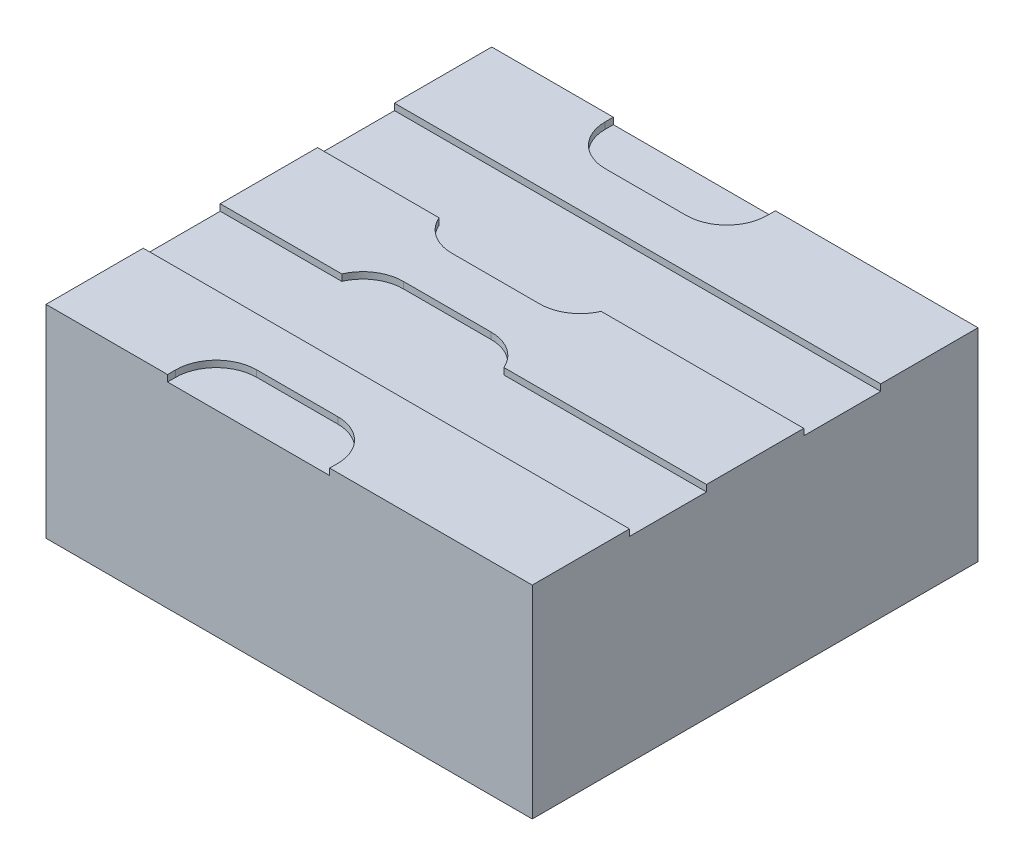
ISO-10303-21;
HEADER;
FILE_DESCRIPTION(('STEP AP214'),'2;1');
FILE_NAME('part.step','',(''),(''),'','','');
FILE_SCHEMA(('AUTOMOTIVE_DESIGN { 1 0 10303 214 1 1 1 1 }'));
ENDSEC;
DATA;
#1=APPLICATION_CONTEXT('core data for automotive mechanical design processes');
#2=APPLICATION_PROTOCOL_DEFINITION('international standard','automotive_design',2000,#1);
#3=PRODUCT_CONTEXT('',#1,'mechanical');
#4=PRODUCT('Part','Part','',(#3));
#5=PRODUCT_RELATED_PRODUCT_CATEGORY('part','',(#4));
#6=PRODUCT_DEFINITION_FORMATION('','',#4);
#7=PRODUCT_DEFINITION_CONTEXT('part definition',#1,'design');
#8=PRODUCT_DEFINITION('design','',#6,#7);
#9=PRODUCT_DEFINITION_SHAPE('','',#8);
#10=(LENGTH_UNIT() NAMED_UNIT(*) SI_UNIT(.MILLI.,.METRE.));
#11=(NAMED_UNIT(*) PLANE_ANGLE_UNIT() SI_UNIT($,.RADIAN.));
#12=(NAMED_UNIT(*) SI_UNIT($,.STERADIAN.) SOLID_ANGLE_UNIT());
#13=UNCERTAINTY_MEASURE_WITH_UNIT(LENGTH_MEASURE(1.E-05),#10,'distance_accuracy_value','');
#14=(GEOMETRIC_REPRESENTATION_CONTEXT(3) GLOBAL_UNCERTAINTY_ASSIGNED_CONTEXT((#13)) GLOBAL_UNIT_ASSIGNED_CONTEXT((#10,
#11,#12)) REPRESENTATION_CONTEXT('',''));
#15=CARTESIAN_POINT('',(0.,0.,0.));
#16=DIRECTION('',(0.,0.,1.));
#17=DIRECTION('',(1.,0.,0.));
#18=AXIS2_PLACEMENT_3D('',#15,#16,#17);
#19=CARTESIAN_POINT('',(1.31107446938112,1.17,0.));
#20=DIRECTION('',(0.,1.,0.));
#21=DIRECTION('',(-1.,0.,0.));
#22=AXIS2_PLACEMENT_3D('',#19,#20,#21);
#23=PLANE('',#22);
#24=DIRECTION('',(1.,0.,0.));
#25=VECTOR('',#24,1.);
#26=CARTESIAN_POINT('',(1.31107446938112,1.17,0.6));
#27=LINE('',#26,#25);
#28=CARTESIAN_POINT('',(0.500000000000001,1.17,0.600000000000001));
#29=VERTEX_POINT('',#28);
#30=CARTESIAN_POINT('',(3.,1.17,0.6));
#31=VERTEX_POINT('',#30);
#32=EDGE_CURVE('E251',#29,#31,#27,.T.);
#33=ORIENTED_EDGE('',*,*,#32,.F.);
#34=CARTESIAN_POINT('',(0.0417424305044164,1.17,0.8));
#35=DIRECTION('',(0.,1.,0.));
#36=DIRECTION('',(-1.,0.,0.));
#37=AXIS2_PLACEMENT_3D('',#34,#35,#36);
#38=CIRCLE('',#37,0.5);
#39=CARTESIAN_POINT('',(0.0417424305044164,1.17,0.3));
#40=VERTEX_POINT('',#39);
#41=EDGE_CURVE('E470',#29,#40,#38,.T.);
#42=ORIENTED_EDGE('',*,*,#41,.T.);
#43=DIRECTION('',(1.,0.,0.));
#44=VECTOR('',#43,1.);
#45=CARTESIAN_POINT('',(-1.99999999999999,1.17,0.3));
#46=LINE('',#45,#44);
#47=CARTESIAN_POINT('',(-1.04174243050442,1.17,0.3));
#48=VERTEX_POINT('',#47);
#49=EDGE_CURVE('E371',#48,#40,#46,.T.);
#50=ORIENTED_EDGE('',*,*,#49,.F.);
#51=CARTESIAN_POINT('',(-1.04174243050442,1.17,0.8));
#52=DIRECTION('',(0.,1.,0.));
#53=DIRECTION('',(-1.,0.,0.));
#54=AXIS2_PLACEMENT_3D('',#51,#52,#53);
#55=CIRCLE('',#54,0.5);
#56=CARTESIAN_POINT('',(-1.5,1.17,0.6));
#57=VERTEX_POINT('',#56);
#58=EDGE_CURVE('E468',#48,#57,#55,.T.);
#59=ORIENTED_EDGE('',*,*,#58,.T.);
#60=DIRECTION('',(1.,0.,0.));
#61=VECTOR('',#60,1.);
#62=CARTESIAN_POINT('',(1.31107446938112,1.17,0.6));
#63=LINE('',#62,#61);
#64=CARTESIAN_POINT('',(-3.,1.17,0.6));
#65=VERTEX_POINT('',#64);
#66=EDGE_CURVE('E292',#65,#57,#63,.T.);
#67=ORIENTED_EDGE('',*,*,#66,.F.);
#68=DIRECTION('',(0.,0.,1.));
#69=VECTOR('',#68,1.);
#70=CARTESIAN_POINT('',(-3.,1.17,2.75));
#71=LINE('',#70,#69);
#72=CARTESIAN_POINT('',(-3.,1.17,1.55));
#73=VERTEX_POINT('',#72);
#74=EDGE_CURVE('E405',#65,#73,#71,.T.);
#75=ORIENTED_EDGE('',*,*,#74,.T.);
#76=DIRECTION('',(-1.,0.,0.));
#77=VECTOR('',#76,1.);
#78=CARTESIAN_POINT('',(-1.99999999999999,1.17,1.55));
#79=LINE('',#78,#77);
#80=CARTESIAN_POINT('',(3.,1.17,1.55));
#81=VERTEX_POINT('',#80);
#82=EDGE_CURVE('E384',#81,#73,#79,.T.);
#83=ORIENTED_EDGE('',*,*,#82,.F.);
#84=DIRECTION('',(0.,0.,-1.));
#85=VECTOR('',#84,1.);
#86=CARTESIAN_POINT('',(3.,1.17,2.75));
#87=LINE('',#86,#85);
#88=EDGE_CURVE('E403',#81,#31,#87,.T.);
#89=ORIENTED_EDGE('',*,*,#88,.T.);
#90=EDGE_LOOP('',(#33,#42,#50,#59,#67,#75,#83,#89));
#91=FACE_BOUND('',#90,.T.);
#92=ADVANCED_FACE('F35',(#91),#23,.T.);
#93=DIRECTION('',(-1.,0.,0.));
#94=VECTOR('',#93,1.);
#95=CARTESIAN_POINT('',(-1.99999999999999,1.17,-0.3));
#96=LINE('',#95,#94);
#97=CARTESIAN_POINT('',(0.0417424305044169,1.17,-0.3));
#98=VERTEX_POINT('',#97);
#99=CARTESIAN_POINT('',(-1.04174243050442,1.17,-0.3));
#100=VERTEX_POINT('',#99);
#101=EDGE_CURVE('E373',#98,#100,#96,.T.);
#102=ORIENTED_EDGE('',*,*,#101,.F.);
#103=CARTESIAN_POINT('',(0.0417424305044169,1.17,-0.8));
#104=DIRECTION('',(0.,1.,0.));
#105=DIRECTION('',(-1.,0.,0.));
#106=AXIS2_PLACEMENT_3D('',#103,#104,#105);
#107=CIRCLE('',#106,0.5);
#108=CARTESIAN_POINT('',(0.500000000000001,1.17,-0.6));
#109=VERTEX_POINT('',#108);
#110=EDGE_CURVE('E466',#98,#109,#107,.T.);
#111=ORIENTED_EDGE('',*,*,#110,.T.);
#112=DIRECTION('',(-1.,0.,0.));
#113=VECTOR('',#112,1.);
#114=CARTESIAN_POINT('',(1.31107446938112,1.17,-0.6));
#115=LINE('',#114,#113);
#116=CARTESIAN_POINT('',(3.,1.17,-0.6));
#117=VERTEX_POINT('',#116);
#118=EDGE_CURVE('E273',#117,#109,#115,.T.);
#119=ORIENTED_EDGE('',*,*,#118,.F.);
#120=CARTESIAN_POINT('',(3.,1.17,-1.55));
#121=VERTEX_POINT('',#120);
#122=EDGE_CURVE('E399',#117,#121,#87,.T.);
#123=ORIENTED_EDGE('',*,*,#122,.T.);
#124=DIRECTION('',(1.,0.,0.));
#125=VECTOR('',#124,1.);
#126=CARTESIAN_POINT('',(-1.99999999999999,1.17,-1.55));
#127=LINE('',#126,#125);
#128=CARTESIAN_POINT('',(-3.,1.17,-1.55));
#129=VERTEX_POINT('',#128);
#130=EDGE_CURVE('E392',#129,#121,#127,.T.);
#131=ORIENTED_EDGE('',*,*,#130,.F.);
#132=CARTESIAN_POINT('',(-3.,1.17,-0.599999999999999));
#133=VERTEX_POINT('',#132);
#134=EDGE_CURVE('E406',#129,#133,#71,.T.);
#135=ORIENTED_EDGE('',*,*,#134,.T.);
#136=DIRECTION('',(-1.,0.,0.));
#137=VECTOR('',#136,1.);
#138=CARTESIAN_POINT('',(1.31107446938112,1.17,-0.6));
#139=LINE('',#138,#137);
#140=CARTESIAN_POINT('',(-1.5,1.17,-0.599999999999999));
#141=VERTEX_POINT('',#140);
#142=EDGE_CURVE('E302',#141,#133,#139,.T.);
#143=ORIENTED_EDGE('',*,*,#142,.F.);
#144=CARTESIAN_POINT('',(-1.04174243050442,1.17,-0.8));
#145=DIRECTION('',(0.,1.,0.));
#146=DIRECTION('',(-1.,0.,0.));
#147=AXIS2_PLACEMENT_3D('',#144,#145,#146);
#148=CIRCLE('',#147,0.5);
#149=EDGE_CURVE('E464',#141,#100,#148,.T.);
#150=ORIENTED_EDGE('',*,*,#149,.T.);
#151=EDGE_LOOP('',(#102,#111,#119,#123,#131,#135,#143,#150));
#152=FACE_BOUND('',#151,.T.);
#153=ADVANCED_FACE('F498',(#152),#23,.T.);
#154=DIRECTION('',(-1.,0.,0.));
#155=VECTOR('',#154,1.);
#156=CARTESIAN_POINT('',(-1.99999999999999,1.17,-2.15));
#157=LINE('',#156,#155);
#158=CARTESIAN_POINT('',(0.,1.17,-2.15));
#159=VERTEX_POINT('',#158);
#160=CARTESIAN_POINT('',(-0.999999999999999,1.17,-2.15));
#161=VERTEX_POINT('',#160);
#162=EDGE_CURVE('E395',#159,#161,#157,.T.);
#163=ORIENTED_EDGE('',*,*,#162,.F.);
#164=CARTESIAN_POINT('',(0.,1.17,-2.65));
#165=DIRECTION('',(0.,1.,0.));
#166=DIRECTION('',(-1.,0.,0.));
#167=AXIS2_PLACEMENT_3D('',#164,#165,#166);
#168=CIRCLE('',#167,0.5);
#169=CARTESIAN_POINT('',(0.500000000000001,1.17,-2.65));
#170=VERTEX_POINT('',#169);
#171=EDGE_CURVE('E441',#159,#170,#168,.T.);
#172=ORIENTED_EDGE('',*,*,#171,.T.);
#173=DIRECTION('',(0.,0.,1.));
#174=VECTOR('',#173,1.);
#175=CARTESIAN_POINT('',(0.500000000000001,1.17,0.));
#176=LINE('',#175,#174);
#177=CARTESIAN_POINT('',(0.500000000000001,1.17,-2.75));
#178=VERTEX_POINT('',#177);
#179=EDGE_CURVE('E332',#178,#170,#176,.T.);
#180=ORIENTED_EDGE('',*,*,#179,.F.);
#181=DIRECTION('',(-1.,0.,0.));
#182=VECTOR('',#181,1.);
#183=CARTESIAN_POINT('',(-3.,1.17,-2.75));
#184=LINE('',#183,#182);
#185=CARTESIAN_POINT('',(-1.5,1.17,-2.75));
#186=VERTEX_POINT('',#185);
#187=EDGE_CURVE('E429',#178,#186,#184,.T.);
#188=ORIENTED_EDGE('',*,*,#187,.T.);
#189=DIRECTION('',(0.,0.,-1.));
#190=VECTOR('',#189,1.);
#191=CARTESIAN_POINT('',(-1.5,1.17,0.));
#192=LINE('',#191,#190);
#193=CARTESIAN_POINT('',(-1.5,1.17,-2.65));
#194=VERTEX_POINT('',#193);
#195=EDGE_CURVE('E366',#194,#186,#192,.T.);
#196=ORIENTED_EDGE('',*,*,#195,.F.);
#197=CARTESIAN_POINT('',(-0.999999999999999,1.17,-2.65));
#198=DIRECTION('',(0.,1.,0.));
#199=DIRECTION('',(-1.,0.,0.));
#200=AXIS2_PLACEMENT_3D('',#197,#198,#199);
#201=CIRCLE('',#200,0.5);
#202=EDGE_CURVE('E439',#194,#161,#201,.T.);
#203=ORIENTED_EDGE('',*,*,#202,.T.);
#204=EDGE_LOOP('',(#163,#172,#180,#188,#196,#203));
#205=FACE_BOUND('',#204,.T.);
#206=ADVANCED_FACE('F520',(#205),#23,.T.);
#207=CARTESIAN_POINT('',(-3.,-1.25,2.75));
#208=DIRECTION('',(1.,0.,0.));
#209=DIRECTION('',(0.,0.,-1.));
#210=AXIS2_PLACEMENT_3D('',#207,#208,#209);
#211=PLANE('',#210);
#212=ORIENTED_EDGE('',*,*,#74,.F.);
#213=DIRECTION('',(0.,1.,0.));
#214=VECTOR('',#213,1.);
#215=CARTESIAN_POINT('',(-3.,1.05,0.6));
#216=LINE('',#215,#214);
#217=CARTESIAN_POINT('',(-3.,1.25,0.6));
#218=VERTEX_POINT('',#217);
#219=EDGE_CURVE('E289',#65,#218,#216,.T.);
#220=ORIENTED_EDGE('',*,*,#219,.T.);
#221=DIRECTION('',(0.,0.,1.));
#222=VECTOR('',#221,1.);
#223=CARTESIAN_POINT('',(-3.,1.25,0.6));
#224=LINE('',#223,#222);
#225=CARTESIAN_POINT('',(-3.,1.25,-0.599999999999999));
#226=VERTEX_POINT('',#225);
#227=EDGE_CURVE('E281',#226,#218,#224,.T.);
#228=ORIENTED_EDGE('',*,*,#227,.F.);
#229=DIRECTION('',(0.,1.,0.));
#230=VECTOR('',#229,1.);
#231=CARTESIAN_POINT('',(-3.,1.05,-0.599999999999999));
#232=LINE('',#231,#230);
#233=EDGE_CURVE('E290',#133,#226,#232,.T.);
#234=ORIENTED_EDGE('',*,*,#233,.F.);
#235=ORIENTED_EDGE('',*,*,#134,.F.);
#236=DIRECTION('',(0.,1.,0.));
#237=VECTOR('',#236,1.);
#238=CARTESIAN_POINT('',(-3.,1.05,-1.55));
#239=LINE('',#238,#237);
#240=CARTESIAN_POINT('',(-3.,1.25,-1.55));
#241=VERTEX_POINT('',#240);
#242=EDGE_CURVE('E363',#129,#241,#239,.T.);
#243=ORIENTED_EDGE('',*,*,#242,.T.);
#244=DIRECTION('',(0.,0.,1.));
#245=VECTOR('',#244,1.);
#246=CARTESIAN_POINT('',(-3.,1.25,-1.55));
#247=LINE('',#246,#245);
#248=CARTESIAN_POINT('',(-3.,1.25,-2.75));
#249=VERTEX_POINT('',#248);
#250=EDGE_CURVE('E359',#249,#241,#247,.T.);
#251=ORIENTED_EDGE('',*,*,#250,.F.);
#252=DIRECTION('',(0.,-1.,0.));
#253=VECTOR('',#252,1.);
#254=CARTESIAN_POINT('',(-3.,-1.25,-2.75));
#255=LINE('',#254,#253);
#256=CARTESIAN_POINT('',(-3.,-1.25,-2.75));
#257=VERTEX_POINT('',#256);
#258=EDGE_CURVE('E411',#249,#257,#255,.T.);
#259=ORIENTED_EDGE('',*,*,#258,.T.);
#260=DIRECTION('',(0.,0.,-1.));
#261=VECTOR('',#260,1.);
#262=CARTESIAN_POINT('',(-3.,-1.25,2.75));
#263=LINE('',#262,#261);
#264=CARTESIAN_POINT('',(-3.,-1.25,2.75));
#265=VERTEX_POINT('',#264);
#266=EDGE_CURVE('E426',#265,#257,#263,.T.);
#267=ORIENTED_EDGE('',*,*,#266,.F.);
#268=DIRECTION('',(0.,-1.,0.));
#269=VECTOR('',#268,1.);
#270=CARTESIAN_POINT('',(-3.,-1.25,2.75));
#271=LINE('',#270,#269);
#272=CARTESIAN_POINT('',(-3.,1.25,2.75));
#273=VERTEX_POINT('',#272);
#274=EDGE_CURVE('E412',#273,#265,#271,.T.);
#275=ORIENTED_EDGE('',*,*,#274,.F.);
#276=DIRECTION('',(0.,0.,1.));
#277=VECTOR('',#276,1.);
#278=CARTESIAN_POINT('',(-3.,1.25,1.55));
#279=LINE('',#278,#277);
#280=CARTESIAN_POINT('',(-3.,1.25,1.55));
#281=VERTEX_POINT('',#280);
#282=EDGE_CURVE('E337',#281,#273,#279,.T.);
#283=ORIENTED_EDGE('',*,*,#282,.F.);
#284=DIRECTION('',(0.,1.,0.));
#285=VECTOR('',#284,1.);
#286=CARTESIAN_POINT('',(-3.,1.05,1.55));
#287=LINE('',#286,#285);
#288=EDGE_CURVE('E346',#73,#281,#287,.T.);
#289=ORIENTED_EDGE('',*,*,#288,.F.);
#290=EDGE_LOOP('',(#212,#220,#228,#234,#235,#243,#251,#259,#267,#275,#283,#289));
#291=FACE_BOUND('',#290,.T.);
#292=ADVANCED_FACE('F539',(#291),#211,.F.);
#293=CARTESIAN_POINT('',(3.,-1.25,2.75));
#294=DIRECTION('',(-1.,0.,0.));
#295=DIRECTION('',(0.,0.,1.));
#296=AXIS2_PLACEMENT_3D('',#293,#294,#295);
#297=PLANE('',#296);
#298=ORIENTED_EDGE('',*,*,#122,.F.);
#299=DIRECTION('',(0.,1.,0.));
#300=VECTOR('',#299,1.);
#301=CARTESIAN_POINT('',(3.,1.05,-0.6));
#302=LINE('',#301,#300);
#303=CARTESIAN_POINT('',(3.,1.25,-0.6));
#304=VERTEX_POINT('',#303);
#305=EDGE_CURVE('E255',#117,#304,#302,.T.);
#306=ORIENTED_EDGE('',*,*,#305,.T.);
#307=DIRECTION('',(0.,0.,-1.));
#308=VECTOR('',#307,1.);
#309=CARTESIAN_POINT('',(3.,1.25,0.6));
#310=LINE('',#309,#308);
#311=CARTESIAN_POINT('',(3.,1.25,0.6));
#312=VERTEX_POINT('',#311);
#313=EDGE_CURVE('E259',#312,#304,#310,.T.);
#314=ORIENTED_EDGE('',*,*,#313,.F.);
#315=DIRECTION('',(0.,1.,0.));
#316=VECTOR('',#315,1.);
#317=CARTESIAN_POINT('',(3.,1.05,0.6));
#318=LINE('',#317,#316);
#319=EDGE_CURVE('E243',#31,#312,#318,.T.);
#320=ORIENTED_EDGE('',*,*,#319,.F.);
#321=ORIENTED_EDGE('',*,*,#88,.F.);
#322=DIRECTION('',(0.,1.,0.));
#323=VECTOR('',#322,1.);
#324=CARTESIAN_POINT('',(3.,1.05,1.55));
#325=LINE('',#324,#323);
#326=CARTESIAN_POINT('',(3.,1.25,1.55));
#327=VERTEX_POINT('',#326);
#328=EDGE_CURVE('E313',#81,#327,#325,.T.);
#329=ORIENTED_EDGE('',*,*,#328,.T.);
#330=DIRECTION('',(0.,0.,-1.));
#331=VECTOR('',#330,1.);
#332=CARTESIAN_POINT('',(3.,1.25,1.55));
#333=LINE('',#332,#331);
#334=CARTESIAN_POINT('',(3.,1.25,2.75));
#335=VERTEX_POINT('',#334);
#336=EDGE_CURVE('E309',#335,#327,#333,.T.);
#337=ORIENTED_EDGE('',*,*,#336,.F.);
#338=DIRECTION('',(0.,1.,0.));
#339=VECTOR('',#338,1.);
#340=CARTESIAN_POINT('',(3.,-1.25,2.75));
#341=LINE('',#340,#339);
#342=CARTESIAN_POINT('',(3.,-1.25,2.75));
#343=VERTEX_POINT('',#342);
#344=EDGE_CURVE('E417',#343,#335,#341,.T.);
#345=ORIENTED_EDGE('',*,*,#344,.F.);
#346=DIRECTION('',(0.,0.,-1.));
#347=VECTOR('',#346,1.);
#348=CARTESIAN_POINT('',(3.,-1.25,2.75));
#349=LINE('',#348,#347);
#350=CARTESIAN_POINT('',(3.,-1.25,-2.75));
#351=VERTEX_POINT('',#350);
#352=EDGE_CURVE('E419',#343,#351,#349,.T.);
#353=ORIENTED_EDGE('',*,*,#352,.T.);
#354=DIRECTION('',(0.,1.,0.));
#355=VECTOR('',#354,1.);
#356=CARTESIAN_POINT('',(3.,-1.25,-2.75));
#357=LINE('',#356,#355);
#358=CARTESIAN_POINT('',(3.,1.25,-2.75));
#359=VERTEX_POINT('',#358);
#360=EDGE_CURVE('E415',#351,#359,#357,.T.);
#361=ORIENTED_EDGE('',*,*,#360,.T.);
#362=DIRECTION('',(0.,0.,-1.));
#363=VECTOR('',#362,1.);
#364=CARTESIAN_POINT('',(3.,1.25,-1.55));
#365=LINE('',#364,#363);
#366=CARTESIAN_POINT('',(3.,1.25,-1.55));
#367=VERTEX_POINT('',#366);
#368=EDGE_CURVE('E323',#367,#359,#365,.T.);
#369=ORIENTED_EDGE('',*,*,#368,.F.);
#370=DIRECTION('',(0.,1.,0.));
#371=VECTOR('',#370,1.);
#372=CARTESIAN_POINT('',(3.,1.05,-1.55));
#373=LINE('',#372,#371);
#374=EDGE_CURVE('E329',#121,#367,#373,.T.);
#375=ORIENTED_EDGE('',*,*,#374,.F.);
#376=EDGE_LOOP('',(#298,#306,#314,#320,#321,#329,#337,#345,#353,#361,#369,#375));
#377=FACE_BOUND('',#376,.T.);
#378=ADVANCED_FACE('F261',(#377),#297,.F.);
#379=CARTESIAN_POINT('',(-3.,1.25,2.75));
#380=DIRECTION('',(0.,0.,1.));
#381=DIRECTION('',(1.,0.,0.));
#382=AXIS2_PLACEMENT_3D('',#379,#380,#381);
#383=PLANE('',#382);
#384=DIRECTION('',(0.,1.,0.));
#385=VECTOR('',#384,1.);
#386=CARTESIAN_POINT('',(0.500000000000001,1.05,2.75));
#387=LINE('',#386,#385);
#388=CARTESIAN_POINT('',(0.500000000000001,1.17,2.75));
#389=VERTEX_POINT('',#388);
#390=CARTESIAN_POINT('',(0.500000000000001,1.25,2.75));
#391=VERTEX_POINT('',#390);
#392=EDGE_CURVE('E312',#389,#391,#387,.T.);
#393=ORIENTED_EDGE('',*,*,#392,.F.);
#394=DIRECTION('',(-1.,0.,0.));
#395=VECTOR('',#394,1.);
#396=CARTESIAN_POINT('',(-3.,1.17,2.75));
#397=LINE('',#396,#395);
#398=CARTESIAN_POINT('',(-1.5,1.17,2.75));
#399=VERTEX_POINT('',#398);
#400=EDGE_CURVE('E409',#389,#399,#397,.T.);
#401=ORIENTED_EDGE('',*,*,#400,.T.);
#402=DIRECTION('',(0.,1.,0.));
#403=VECTOR('',#402,1.);
#404=CARTESIAN_POINT('',(-1.5,1.05,2.75));
#405=LINE('',#404,#403);
#406=CARTESIAN_POINT('',(-1.5,1.25,2.75));
#407=VERTEX_POINT('',#406);
#408=EDGE_CURVE('E347',#399,#407,#405,.T.);
#409=ORIENTED_EDGE('',*,*,#408,.T.);
#410=DIRECTION('',(1.,0.,0.));
#411=VECTOR('',#410,1.);
#412=CARTESIAN_POINT('',(-1.5,1.25,2.75));
#413=LINE('',#412,#411);
#414=EDGE_CURVE('E340',#273,#407,#413,.T.);
#415=ORIENTED_EDGE('',*,*,#414,.F.);
#416=ORIENTED_EDGE('',*,*,#274,.T.);
#417=DIRECTION('',(1.,0.,0.));
#418=VECTOR('',#417,1.);
#419=CARTESIAN_POINT('',(3.,-1.25,2.75));
#420=LINE('',#419,#418);
#421=EDGE_CURVE('E414',#265,#343,#420,.T.);
#422=ORIENTED_EDGE('',*,*,#421,.T.);
#423=ORIENTED_EDGE('',*,*,#344,.T.);
#424=DIRECTION('',(1.,0.,0.));
#425=VECTOR('',#424,1.);
#426=CARTESIAN_POINT('',(0.500000000000001,1.25,2.75));
#427=LINE('',#426,#425);
#428=EDGE_CURVE('E306',#391,#335,#427,.T.);
#429=ORIENTED_EDGE('',*,*,#428,.F.);
#430=EDGE_LOOP('',(#393,#401,#409,#415,#416,#422,#423,#429));
#431=FACE_BOUND('',#430,.T.);
#432=ADVANCED_FACE('F590',(#431),#383,.T.);
#433=CARTESIAN_POINT('',(-3.,1.25,-2.75));
#434=DIRECTION('',(0.,0.,1.));
#435=DIRECTION('',(1.,0.,0.));
#436=AXIS2_PLACEMENT_3D('',#433,#434,#435);
#437=PLANE('',#436);
#438=ORIENTED_EDGE('',*,*,#187,.F.);
#439=DIRECTION('',(0.,1.,0.));
#440=VECTOR('',#439,1.);
#441=CARTESIAN_POINT('',(0.500000000000001,1.05,-2.75));
#442=LINE('',#441,#440);
#443=CARTESIAN_POINT('',(0.500000000000001,1.25,-2.75));
#444=VERTEX_POINT('',#443);
#445=EDGE_CURVE('E330',#178,#444,#442,.T.);
#446=ORIENTED_EDGE('',*,*,#445,.T.);
#447=DIRECTION('',(-1.,0.,0.));
#448=VECTOR('',#447,1.);
#449=CARTESIAN_POINT('',(0.500000000000001,1.25,-2.75));
#450=LINE('',#449,#448);
#451=EDGE_CURVE('E326',#359,#444,#450,.T.);
#452=ORIENTED_EDGE('',*,*,#451,.F.);
#453=ORIENTED_EDGE('',*,*,#360,.F.);
#454=DIRECTION('',(1.,0.,0.));
#455=VECTOR('',#454,1.);
#456=CARTESIAN_POINT('',(3.,-1.25,-2.75));
#457=LINE('',#456,#455);
#458=EDGE_CURVE('E421',#257,#351,#457,.T.);
#459=ORIENTED_EDGE('',*,*,#458,.F.);
#460=ORIENTED_EDGE('',*,*,#258,.F.);
#461=DIRECTION('',(-1.,0.,0.));
#462=VECTOR('',#461,1.);
#463=CARTESIAN_POINT('',(-1.5,1.25,-2.75));
#464=LINE('',#463,#462);
#465=CARTESIAN_POINT('',(-1.5,1.25,-2.75));
#466=VERTEX_POINT('',#465);
#467=EDGE_CURVE('E356',#466,#249,#464,.T.);
#468=ORIENTED_EDGE('',*,*,#467,.F.);
#469=DIRECTION('',(0.,1.,0.));
#470=VECTOR('',#469,1.);
#471=CARTESIAN_POINT('',(-1.5,1.05,-2.75));
#472=LINE('',#471,#470);
#473=EDGE_CURVE('E362',#186,#466,#472,.T.);
#474=ORIENTED_EDGE('',*,*,#473,.F.);
#475=EDGE_LOOP('',(#438,#446,#452,#453,#459,#460,#468,#474));
#476=FACE_BOUND('',#475,.T.);
#477=ADVANCED_FACE('F534',(#476),#437,.F.);
#478=CARTESIAN_POINT('',(3.,-1.25,2.75));
#479=DIRECTION('',(0.,1.,0.));
#480=DIRECTION('',(-1.,0.,0.));
#481=AXIS2_PLACEMENT_3D('',#478,#479,#480);
#482=PLANE('',#481);
#483=ORIENTED_EDGE('',*,*,#458,.T.);
#484=ORIENTED_EDGE('',*,*,#352,.F.);
#485=ORIENTED_EDGE('',*,*,#421,.F.);
#486=ORIENTED_EDGE('',*,*,#266,.T.);
#487=EDGE_LOOP('',(#483,#484,#485,#486));
#488=FACE_BOUND('',#487,.T.);
#489=ADVANCED_FACE('F525',(#488),#482,.F.);
#490=DIRECTION('',(1.,0.,0.));
#491=VECTOR('',#490,1.);
#492=CARTESIAN_POINT('',(-1.99999999999999,1.17,2.15));
#493=LINE('',#492,#491);
#494=CARTESIAN_POINT('',(-0.999999999999999,1.17,2.15));
#495=VERTEX_POINT('',#494);
#496=CARTESIAN_POINT('',(0.,1.17,2.15));
#497=VERTEX_POINT('',#496);
#498=EDGE_CURVE('E381',#495,#497,#493,.T.);
#499=ORIENTED_EDGE('',*,*,#498,.F.);
#500=CARTESIAN_POINT('',(-0.999999999999999,1.17,2.65));
#501=DIRECTION('',(0.,1.,0.));
#502=DIRECTION('',(-1.,0.,0.));
#503=AXIS2_PLACEMENT_3D('',#500,#501,#502);
#504=CIRCLE('',#503,0.5);
#505=CARTESIAN_POINT('',(-1.5,1.17,2.65));
#506=VERTEX_POINT('',#505);
#507=EDGE_CURVE('E455',#495,#506,#504,.T.);
#508=ORIENTED_EDGE('',*,*,#507,.T.);
#509=DIRECTION('',(0.,0.,-1.));
#510=VECTOR('',#509,1.);
#511=CARTESIAN_POINT('',(-1.5,1.17,0.));
#512=LINE('',#511,#510);
#513=EDGE_CURVE('E349',#399,#506,#512,.T.);
#514=ORIENTED_EDGE('',*,*,#513,.F.);
#515=ORIENTED_EDGE('',*,*,#400,.F.);
#516=DIRECTION('',(0.,0.,1.));
#517=VECTOR('',#516,1.);
#518=CARTESIAN_POINT('',(0.500000000000001,1.17,0.));
#519=LINE('',#518,#517);
#520=CARTESIAN_POINT('',(0.500000000000001,1.17,2.65));
#521=VERTEX_POINT('',#520);
#522=EDGE_CURVE('E316',#521,#389,#519,.T.);
#523=ORIENTED_EDGE('',*,*,#522,.F.);
#524=CARTESIAN_POINT('',(0.,1.17,2.65));
#525=DIRECTION('',(0.,1.,0.));
#526=DIRECTION('',(-1.,0.,0.));
#527=AXIS2_PLACEMENT_3D('',#524,#525,#526);
#528=CIRCLE('',#527,0.5);
#529=EDGE_CURVE('E453',#521,#497,#528,.T.);
#530=ORIENTED_EDGE('',*,*,#529,.T.);
#531=EDGE_LOOP('',(#499,#508,#514,#515,#523,#530));
#532=FACE_BOUND('',#531,.T.);
#533=ADVANCED_FACE('F516',(#532),#23,.T.);
#534=CARTESIAN_POINT('',(-1.99999999999999,1.17,-2.15));
#535=DIRECTION('',(0.,0.,-1.));
#536=DIRECTION('',(-1.,0.,0.));
#537=AXIS2_PLACEMENT_3D('',#534,#535,#536);
#538=PLANE('',#537);
#539=DIRECTION('',(-1.,0.,0.));
#540=VECTOR('',#539,1.);
#541=CARTESIAN_POINT('',(-1.99999999999999,1.25,-2.15));
#542=LINE('',#541,#540);
#543=CARTESIAN_POINT('',(0.,1.25,-2.15));
#544=VERTEX_POINT('',#543);
#545=CARTESIAN_POINT('',(-0.999999999999999,1.25,-2.15));
#546=VERTEX_POINT('',#545);
#547=EDGE_CURVE('E396',#544,#546,#542,.T.);
#548=ORIENTED_EDGE('',*,*,#547,.F.);
#549=DIRECTION('',(0.,1.,0.));
#550=VECTOR('',#549,1.);
#551=CARTESIAN_POINT('',(0.,1.17,-2.15));
#552=LINE('',#551,#550);
#553=EDGE_CURVE('E437',#544,#159,#552,.F.);
#554=ORIENTED_EDGE('',*,*,#553,.T.);
#555=ORIENTED_EDGE('',*,*,#162,.T.);
#556=DIRECTION('',(0.,-1.,0.));
#557=VECTOR('',#556,1.);
#558=CARTESIAN_POINT('',(-0.999999999999999,1.25,-2.15));
#559=LINE('',#558,#557);
#560=EDGE_CURVE('E435',#161,#546,#559,.F.);
#561=ORIENTED_EDGE('',*,*,#560,.T.);
#562=EDGE_LOOP('',(#548,#554,#555,#561));
#563=FACE_BOUND('',#562,.T.);
#564=ADVANCED_FACE('F524',(#563),#538,.T.);
#565=CARTESIAN_POINT('',(-1.99999999999999,1.17,-1.55));
#566=DIRECTION('',(0.,0.,1.));
#567=DIRECTION('',(1.,0.,0.));
#568=AXIS2_PLACEMENT_3D('',#565,#566,#567);
#569=PLANE('',#568);
#570=ORIENTED_EDGE('',*,*,#130,.T.);
#571=ORIENTED_EDGE('',*,*,#374,.T.);
#572=DIRECTION('',(1.,0.,0.));
#573=VECTOR('',#572,1.);
#574=CARTESIAN_POINT('',(-1.99999999999999,1.25,-1.55));
#575=LINE('',#574,#573);
#576=EDGE_CURVE('E388',#241,#367,#575,.T.);
#577=ORIENTED_EDGE('',*,*,#576,.F.);
#578=ORIENTED_EDGE('',*,*,#242,.F.);
#579=EDGE_LOOP('',(#570,#571,#577,#578));
#580=FACE_BOUND('',#579,.T.);
#581=ADVANCED_FACE('F531',(#580),#569,.T.);
#582=CARTESIAN_POINT('',(-1.99999999999999,1.17,2.15));
#583=DIRECTION('',(0.,0.,1.));
#584=DIRECTION('',(1.,0.,0.));
#585=AXIS2_PLACEMENT_3D('',#582,#583,#584);
#586=PLANE('',#585);
#587=DIRECTION('',(1.,0.,0.));
#588=VECTOR('',#587,1.);
#589=CARTESIAN_POINT('',(-1.99999999999999,1.25,2.15));
#590=LINE('',#589,#588);
#591=CARTESIAN_POINT('',(-0.999999999999999,1.25,2.15));
#592=VERTEX_POINT('',#591);
#593=CARTESIAN_POINT('',(0.,1.25,2.15));
#594=VERTEX_POINT('',#593);
#595=EDGE_CURVE('E377',#592,#594,#590,.T.);
#596=ORIENTED_EDGE('',*,*,#595,.F.);
#597=DIRECTION('',(0.,1.,0.));
#598=VECTOR('',#597,1.);
#599=CARTESIAN_POINT('',(-0.999999999999999,1.17,2.15));
#600=LINE('',#599,#598);
#601=EDGE_CURVE('E451',#592,#495,#600,.F.);
#602=ORIENTED_EDGE('',*,*,#601,.T.);
#603=ORIENTED_EDGE('',*,*,#498,.T.);
#604=DIRECTION('',(0.,-1.,0.));
#605=VECTOR('',#604,1.);
#606=CARTESIAN_POINT('',(0.,1.25,2.15));
#607=LINE('',#606,#605);
#608=EDGE_CURVE('E449',#497,#594,#607,.F.);
#609=ORIENTED_EDGE('',*,*,#608,.T.);
#610=EDGE_LOOP('',(#596,#602,#603,#609));
#611=FACE_BOUND('',#610,.T.);
#612=ADVANCED_FACE('F690',(#611),#586,.T.);
#613=CARTESIAN_POINT('',(-1.99999999999999,1.17,1.55));
#614=DIRECTION('',(0.,0.,-1.));
#615=DIRECTION('',(-1.,0.,0.));
#616=AXIS2_PLACEMENT_3D('',#613,#614,#615);
#617=PLANE('',#616);
#618=ORIENTED_EDGE('',*,*,#288,.T.);
#619=DIRECTION('',(-1.,0.,0.));
#620=VECTOR('',#619,1.);
#621=CARTESIAN_POINT('',(-1.99999999999999,1.25,1.55));
#622=LINE('',#621,#620);
#623=EDGE_CURVE('E385',#327,#281,#622,.T.);
#624=ORIENTED_EDGE('',*,*,#623,.F.);
#625=ORIENTED_EDGE('',*,*,#328,.F.);
#626=ORIENTED_EDGE('',*,*,#82,.T.);
#627=EDGE_LOOP('',(#618,#624,#625,#626));
#628=FACE_BOUND('',#627,.T.);
#629=ADVANCED_FACE('F597',(#628),#617,.T.);
#630=CARTESIAN_POINT('',(-1.99999999999999,1.17,-0.3));
#631=DIRECTION('',(0.,0.,-1.));
#632=DIRECTION('',(-1.,0.,0.));
#633=AXIS2_PLACEMENT_3D('',#630,#631,#632);
#634=PLANE('',#633);
#635=DIRECTION('',(-1.,0.,0.));
#636=VECTOR('',#635,1.);
#637=CARTESIAN_POINT('',(-1.99999999999999,1.25,-0.3));
#638=LINE('',#637,#636);
#639=CARTESIAN_POINT('',(0.0417424305044168,1.25,-0.3));
#640=VERTEX_POINT('',#639);
#641=CARTESIAN_POINT('',(-1.04174243050442,1.25,-0.3));
#642=VERTEX_POINT('',#641);
#643=EDGE_CURVE('E374',#640,#642,#638,.T.);
#644=ORIENTED_EDGE('',*,*,#643,.F.);
#645=DIRECTION('',(0.,1.,0.));
#646=VECTOR('',#645,1.);
#647=CARTESIAN_POINT('',(0.0417424305044169,1.17,-0.3));
#648=LINE('',#647,#646);
#649=EDGE_CURVE('E462',#640,#98,#648,.F.);
#650=ORIENTED_EDGE('',*,*,#649,.T.);
#651=ORIENTED_EDGE('',*,*,#101,.T.);
#652=DIRECTION('',(0.,-1.,0.));
#653=VECTOR('',#652,1.);
#654=CARTESIAN_POINT('',(-1.04174243050442,1.25,-0.3));
#655=LINE('',#654,#653);
#656=EDGE_CURVE('E460',#100,#642,#655,.F.);
#657=ORIENTED_EDGE('',*,*,#656,.T.);
#658=EDGE_LOOP('',(#644,#650,#651,#657));
#659=FACE_BOUND('',#658,.T.);
#660=ADVANCED_FACE('F491',(#659),#634,.T.);
#661=CARTESIAN_POINT('',(-1.99999999999999,1.17,0.3));
#662=DIRECTION('',(0.,0.,1.));
#663=DIRECTION('',(1.,0.,0.));
#664=AXIS2_PLACEMENT_3D('',#661,#662,#663);
#665=PLANE('',#664);
#666=ORIENTED_EDGE('',*,*,#49,.T.);
#667=DIRECTION('',(0.,-1.,0.));
#668=VECTOR('',#667,1.);
#669=CARTESIAN_POINT('',(0.0417424305044164,1.25,0.3));
#670=LINE('',#669,#668);
#671=CARTESIAN_POINT('',(0.0417424305044164,1.25,0.3));
#672=VERTEX_POINT('',#671);
#673=EDGE_CURVE('E50',#40,#672,#670,.F.);
#674=ORIENTED_EDGE('',*,*,#673,.T.);
#675=DIRECTION('',(1.,0.,0.));
#676=VECTOR('',#675,1.);
#677=CARTESIAN_POINT('',(-1.99999999999999,1.25,0.3));
#678=LINE('',#677,#676);
#679=CARTESIAN_POINT('',(-1.04174243050442,1.25,0.3));
#680=VERTEX_POINT('',#679);
#681=EDGE_CURVE('E370',#680,#672,#678,.T.);
#682=ORIENTED_EDGE('',*,*,#681,.F.);
#683=DIRECTION('',(0.,1.,0.));
#684=VECTOR('',#683,1.);
#685=CARTESIAN_POINT('',(-1.04174243050442,1.17,0.3));
#686=LINE('',#685,#684);
#687=EDGE_CURVE('E472',#680,#48,#686,.F.);
#688=ORIENTED_EDGE('',*,*,#687,.T.);
#689=EDGE_LOOP('',(#666,#674,#682,#688));
#690=FACE_BOUND('',#689,.T.);
#691=ADVANCED_FACE('F608',(#690),#665,.T.);
#692=CARTESIAN_POINT('',(3.,1.25,2.75));
#693=DIRECTION('',(0.,-1.,0.));
#694=DIRECTION('',(1.,0.,0.));
#695=AXIS2_PLACEMENT_3D('',#692,#693,#694);
#696=PLANE('',#695);
#697=DIRECTION('',(-1.,0.,0.));
#698=VECTOR('',#697,1.);
#699=CARTESIAN_POINT('',(0.500000000000001,1.25,-0.6));
#700=LINE('',#699,#698);
#701=CARTESIAN_POINT('',(0.500000000000001,1.25,-0.6));
#702=VERTEX_POINT('',#701);
#703=EDGE_CURVE('E256',#304,#702,#700,.T.);
#704=ORIENTED_EDGE('',*,*,#703,.T.);
#705=CARTESIAN_POINT('',(0.0417424305044169,1.25,-0.8));
#706=DIRECTION('',(0.,-1.,0.));
#707=DIRECTION('',(1.,0.,0.));
#708=AXIS2_PLACEMENT_3D('',#705,#706,#707);
#709=CIRCLE('',#708,0.5);
#710=EDGE_CURVE('E483',#702,#640,#709,.T.);
#711=ORIENTED_EDGE('',*,*,#710,.T.);
#712=ORIENTED_EDGE('',*,*,#643,.T.);
#713=CARTESIAN_POINT('',(-1.04174243050442,1.25,-0.8));
#714=DIRECTION('',(0.,-1.,0.));
#715=DIRECTION('',(1.,0.,0.));
#716=AXIS2_PLACEMENT_3D('',#713,#714,#715);
#717=CIRCLE('',#716,0.5);
#718=CARTESIAN_POINT('',(-1.5,1.25,-0.599999999999999));
#719=VERTEX_POINT('',#718);
#720=EDGE_CURVE('E12',#642,#719,#717,.T.);
#721=ORIENTED_EDGE('',*,*,#720,.T.);
#722=DIRECTION('',(-1.,0.,0.));
#723=VECTOR('',#722,1.);
#724=CARTESIAN_POINT('',(-1.5,1.25,-0.599999999999999));
#725=LINE('',#724,#723);
#726=EDGE_CURVE('E286',#719,#226,#725,.T.);
#727=ORIENTED_EDGE('',*,*,#726,.T.);
#728=ORIENTED_EDGE('',*,*,#227,.T.);
#729=DIRECTION('',(1.,0.,0.));
#730=VECTOR('',#729,1.);
#731=CARTESIAN_POINT('',(-1.5,1.25,0.6));
#732=LINE('',#731,#730);
#733=CARTESIAN_POINT('',(-1.5,1.25,0.6));
#734=VERTEX_POINT('',#733);
#735=EDGE_CURVE('E284',#218,#734,#732,.T.);
#736=ORIENTED_EDGE('',*,*,#735,.T.);
#737=CARTESIAN_POINT('',(-1.04174243050442,1.25,0.8));
#738=DIRECTION('',(0.,-1.,0.));
#739=DIRECTION('',(1.,0.,0.));
#740=AXIS2_PLACEMENT_3D('',#737,#738,#739);
#741=CIRCLE('',#740,0.5);
#742=EDGE_CURVE('E43',#734,#680,#741,.T.);
#743=ORIENTED_EDGE('',*,*,#742,.T.);
#744=ORIENTED_EDGE('',*,*,#681,.T.);
#745=CARTESIAN_POINT('',(0.0417424305044164,1.25,0.8));
#746=DIRECTION('',(0.,-1.,0.));
#747=DIRECTION('',(1.,0.,0.));
#748=AXIS2_PLACEMENT_3D('',#745,#746,#747);
#749=CIRCLE('',#748,0.5);
#750=CARTESIAN_POINT('',(0.500000000000001,1.25,0.600000000000001));
#751=VERTEX_POINT('',#750);
#752=EDGE_CURVE('E267',#672,#751,#749,.T.);
#753=ORIENTED_EDGE('',*,*,#752,.T.);
#754=DIRECTION('',(1.,0.,0.));
#755=VECTOR('',#754,1.);
#756=CARTESIAN_POINT('',(0.500000000000001,1.25,0.600000000000001));
#757=LINE('',#756,#755);
#758=EDGE_CURVE('E248',#751,#312,#757,.T.);
#759=ORIENTED_EDGE('',*,*,#758,.T.);
#760=ORIENTED_EDGE('',*,*,#313,.T.);
#761=EDGE_LOOP('',(#704,#711,#712,#721,#727,#728,#736,#743,#744,#753,#759,#760));
#762=FACE_BOUND('',#761,.T.);
#763=ADVANCED_FACE('F265',(#762),#696,.F.);
#764=DIRECTION('',(0.,0.,-1.));
#765=VECTOR('',#764,1.);
#766=CARTESIAN_POINT('',(-1.5,1.25,1.55));
#767=LINE('',#766,#765);
#768=CARTESIAN_POINT('',(-1.5,1.25,2.65));
#769=VERTEX_POINT('',#768);
#770=EDGE_CURVE('E343',#407,#769,#767,.T.);
#771=ORIENTED_EDGE('',*,*,#770,.T.);
#772=CARTESIAN_POINT('',(-0.999999999999999,1.25,2.65));
#773=DIRECTION('',(0.,-1.,0.));
#774=DIRECTION('',(1.,0.,0.));
#775=AXIS2_PLACEMENT_3D('',#772,#773,#774);
#776=CIRCLE('',#775,0.5);
#777=EDGE_CURVE('E479',#769,#592,#776,.T.);
#778=ORIENTED_EDGE('',*,*,#777,.T.);
#779=ORIENTED_EDGE('',*,*,#595,.T.);
#780=CARTESIAN_POINT('',(0.,1.25,2.65));
#781=DIRECTION('',(0.,-1.,0.));
#782=DIRECTION('',(1.,0.,0.));
#783=AXIS2_PLACEMENT_3D('',#780,#781,#782);
#784=CIRCLE('',#783,0.5);
#785=CARTESIAN_POINT('',(0.500000000000001,1.25,2.65));
#786=VERTEX_POINT('',#785);
#787=EDGE_CURVE('E481',#594,#786,#784,.T.);
#788=ORIENTED_EDGE('',*,*,#787,.T.);
#789=DIRECTION('',(0.,0.,1.));
#790=VECTOR('',#789,1.);
#791=CARTESIAN_POINT('',(0.500000000000001,1.25,1.55));
#792=LINE('',#791,#790);
#793=EDGE_CURVE('E304',#786,#391,#792,.T.);
#794=ORIENTED_EDGE('',*,*,#793,.T.);
#795=ORIENTED_EDGE('',*,*,#428,.T.);
#796=ORIENTED_EDGE('',*,*,#336,.T.);
#797=ORIENTED_EDGE('',*,*,#623,.T.);
#798=ORIENTED_EDGE('',*,*,#282,.T.);
#799=ORIENTED_EDGE('',*,*,#414,.T.);
#800=EDGE_LOOP('',(#771,#778,#779,#788,#794,#795,#796,#797,#798,#799));
#801=FACE_BOUND('',#800,.T.);
#802=ADVANCED_FACE('F594',(#801),#696,.F.);
#803=DIRECTION('',(0.,0.,1.));
#804=VECTOR('',#803,1.);
#805=CARTESIAN_POINT('',(0.500000000000001,1.25,-1.55));
#806=LINE('',#805,#804);
#807=CARTESIAN_POINT('',(0.500000000000001,1.25,-2.65));
#808=VERTEX_POINT('',#807);
#809=EDGE_CURVE('E320',#444,#808,#806,.T.);
#810=ORIENTED_EDGE('',*,*,#809,.T.);
#811=CARTESIAN_POINT('',(0.,1.25,-2.65));
#812=DIRECTION('',(0.,-1.,0.));
#813=DIRECTION('',(1.,0.,0.));
#814=AXIS2_PLACEMENT_3D('',#811,#812,#813);
#815=CIRCLE('',#814,0.5);
#816=EDGE_CURVE('E475',#808,#544,#815,.T.);
#817=ORIENTED_EDGE('',*,*,#816,.T.);
#818=ORIENTED_EDGE('',*,*,#547,.T.);
#819=CARTESIAN_POINT('',(-0.999999999999999,1.25,-2.65));
#820=DIRECTION('',(0.,-1.,0.));
#821=DIRECTION('',(1.,0.,0.));
#822=AXIS2_PLACEMENT_3D('',#819,#820,#821);
#823=CIRCLE('',#822,0.5);
#824=CARTESIAN_POINT('',(-1.5,1.25,-2.65));
#825=VERTEX_POINT('',#824);
#826=EDGE_CURVE('E477',#546,#825,#823,.T.);
#827=ORIENTED_EDGE('',*,*,#826,.T.);
#828=DIRECTION('',(0.,0.,-1.));
#829=VECTOR('',#828,1.);
#830=CARTESIAN_POINT('',(-1.5,1.25,-1.55));
#831=LINE('',#830,#829);
#832=EDGE_CURVE('E354',#825,#466,#831,.T.);
#833=ORIENTED_EDGE('',*,*,#832,.T.);
#834=ORIENTED_EDGE('',*,*,#467,.T.);
#835=ORIENTED_EDGE('',*,*,#250,.T.);
#836=ORIENTED_EDGE('',*,*,#576,.T.);
#837=ORIENTED_EDGE('',*,*,#368,.T.);
#838=ORIENTED_EDGE('',*,*,#451,.T.);
#839=EDGE_LOOP('',(#810,#817,#818,#827,#833,#834,#835,#836,#837,#838));
#840=FACE_BOUND('',#839,.T.);
#841=ADVANCED_FACE('F557',(#840),#696,.F.);
#842=CARTESIAN_POINT('',(-1.5,1.05,-1.55));
#843=DIRECTION('',(1.,0.,0.));
#844=DIRECTION('',(0.,0.,-1.));
#845=AXIS2_PLACEMENT_3D('',#842,#843,#844);
#846=PLANE('',#845);
#847=ORIENTED_EDGE('',*,*,#832,.F.);
#848=DIRECTION('',(0.,-1.,0.));
#849=VECTOR('',#848,1.);
#850=CARTESIAN_POINT('',(-1.5,1.17,-2.65));
#851=LINE('',#850,#849);
#852=EDGE_CURVE('E443',#825,#194,#851,.T.);
#853=ORIENTED_EDGE('',*,*,#852,.T.);
#854=ORIENTED_EDGE('',*,*,#195,.T.);
#855=ORIENTED_EDGE('',*,*,#473,.T.);
#856=EDGE_LOOP('',(#847,#853,#854,#855));
#857=FACE_BOUND('',#856,.T.);
#858=ADVANCED_FACE('F569',(#857),#846,.T.);
#859=CARTESIAN_POINT('',(-1.5,1.05,1.55));
#860=DIRECTION('',(1.,0.,0.));
#861=DIRECTION('',(0.,0.,-1.));
#862=AXIS2_PLACEMENT_3D('',#859,#860,#861);
#863=PLANE('',#862);
#864=ORIENTED_EDGE('',*,*,#513,.T.);
#865=DIRECTION('',(0.,1.,0.));
#866=VECTOR('',#865,1.);
#867=CARTESIAN_POINT('',(-1.5,1.25,2.65));
#868=LINE('',#867,#866);
#869=EDGE_CURVE('E446',#506,#769,#868,.T.);
#870=ORIENTED_EDGE('',*,*,#869,.T.);
#871=ORIENTED_EDGE('',*,*,#770,.F.);
#872=ORIENTED_EDGE('',*,*,#408,.F.);
#873=EDGE_LOOP('',(#864,#870,#871,#872));
#874=FACE_BOUND('',#873,.T.);
#875=ADVANCED_FACE('F757',(#874),#863,.T.);
#876=CARTESIAN_POINT('',(0.500000000000001,1.05,-1.55));
#877=DIRECTION('',(-1.,0.,0.));
#878=DIRECTION('',(0.,-1.,0.));
#879=AXIS2_PLACEMENT_3D('',#876,#877,#878);
#880=PLANE('',#879);
#881=ORIENTED_EDGE('',*,*,#179,.T.);
#882=DIRECTION('',(0.,1.,0.));
#883=VECTOR('',#882,1.);
#884=CARTESIAN_POINT('',(0.500000000000001,1.25,-2.65));
#885=LINE('',#884,#883);
#886=EDGE_CURVE('E432',#170,#808,#885,.T.);
#887=ORIENTED_EDGE('',*,*,#886,.T.);
#888=ORIENTED_EDGE('',*,*,#809,.F.);
#889=ORIENTED_EDGE('',*,*,#445,.F.);
#890=EDGE_LOOP('',(#881,#887,#888,#889));
#891=FACE_BOUND('',#890,.T.);
#892=ADVANCED_FACE('F555',(#891),#880,.T.);
#893=CARTESIAN_POINT('',(0.500000000000001,1.05,1.55));
#894=DIRECTION('',(-1.,0.,0.));
#895=DIRECTION('',(0.,0.,1.));
#896=AXIS2_PLACEMENT_3D('',#893,#894,#895);
#897=PLANE('',#896);
#898=ORIENTED_EDGE('',*,*,#793,.F.);
#899=DIRECTION('',(0.,-1.,0.));
#900=VECTOR('',#899,1.);
#901=CARTESIAN_POINT('',(0.500000000000001,1.17,2.65));
#902=LINE('',#901,#900);
#903=EDGE_CURVE('E457',#786,#521,#902,.T.);
#904=ORIENTED_EDGE('',*,*,#903,.T.);
#905=ORIENTED_EDGE('',*,*,#522,.T.);
#906=ORIENTED_EDGE('',*,*,#392,.T.);
#907=EDGE_LOOP('',(#898,#904,#905,#906));
#908=FACE_BOUND('',#907,.T.);
#909=ADVANCED_FACE('F773',(#908),#897,.T.);
#910=CARTESIAN_POINT('',(-1.5,1.05,-0.599999999999999));
#911=DIRECTION('',(0.,0.,-1.));
#912=DIRECTION('',(-1.,0.,0.));
#913=AXIS2_PLACEMENT_3D('',#910,#911,#912);
#914=PLANE('',#913);
#915=DIRECTION('',(0.,1.,0.));
#916=VECTOR('',#915,1.);
#917=CARTESIAN_POINT('',(-1.5,1.05,-0.599999999999999));
#918=LINE('',#917,#916);
#919=EDGE_CURVE('E293',#141,#719,#918,.T.);
#920=ORIENTED_EDGE('',*,*,#919,.F.);
#921=ORIENTED_EDGE('',*,*,#142,.T.);
#922=ORIENTED_EDGE('',*,*,#233,.T.);
#923=ORIENTED_EDGE('',*,*,#726,.F.);
#924=EDGE_LOOP('',(#920,#921,#922,#923));
#925=FACE_BOUND('',#924,.T.);
#926=ADVANCED_FACE('F781',(#925),#914,.T.);
#927=CARTESIAN_POINT('',(-1.5,1.05,0.6));
#928=DIRECTION('',(0.,0.,1.));
#929=DIRECTION('',(1.,0.,0.));
#930=AXIS2_PLACEMENT_3D('',#927,#928,#929);
#931=PLANE('',#930);
#932=ORIENTED_EDGE('',*,*,#219,.F.);
#933=ORIENTED_EDGE('',*,*,#66,.T.);
#934=DIRECTION('',(0.,1.,0.));
#935=VECTOR('',#934,1.);
#936=CARTESIAN_POINT('',(-1.5,1.05,0.6));
#937=LINE('',#936,#935);
#938=EDGE_CURVE('E296',#57,#734,#937,.T.);
#939=ORIENTED_EDGE('',*,*,#938,.T.);
#940=ORIENTED_EDGE('',*,*,#735,.F.);
#941=EDGE_LOOP('',(#932,#933,#939,#940));
#942=FACE_BOUND('',#941,.T.);
#943=ADVANCED_FACE('F511',(#942),#931,.T.);
#944=CARTESIAN_POINT('',(0.500000000000001,1.05,0.600000000000001));
#945=DIRECTION('',(0.,0.,1.));
#946=DIRECTION('',(1.,0.,0.));
#947=AXIS2_PLACEMENT_3D('',#944,#945,#946);
#948=PLANE('',#947);
#949=DIRECTION('',(0.,1.,0.));
#950=VECTOR('',#949,1.);
#951=CARTESIAN_POINT('',(0.500000000000001,1.05,0.600000000000001));
#952=LINE('',#951,#950);
#953=EDGE_CURVE('E271',#29,#751,#952,.T.);
#954=ORIENTED_EDGE('',*,*,#953,.F.);
#955=ORIENTED_EDGE('',*,*,#32,.T.);
#956=ORIENTED_EDGE('',*,*,#319,.T.);
#957=ORIENTED_EDGE('',*,*,#758,.F.);
#958=EDGE_LOOP('',(#954,#955,#956,#957));
#959=FACE_BOUND('',#958,.T.);
#960=ADVANCED_FACE('F246',(#959),#948,.T.);
#961=CARTESIAN_POINT('',(0.500000000000001,1.05,-0.6));
#962=DIRECTION('',(0.,0.,-1.));
#963=DIRECTION('',(-1.,0.,0.));
#964=AXIS2_PLACEMENT_3D('',#961,#962,#963);
#965=PLANE('',#964);
#966=ORIENTED_EDGE('',*,*,#305,.F.);
#967=ORIENTED_EDGE('',*,*,#118,.T.);
#968=DIRECTION('',(0.,1.,0.));
#969=VECTOR('',#968,1.);
#970=CARTESIAN_POINT('',(0.500000000000001,1.05,-0.6));
#971=LINE('',#970,#969);
#972=EDGE_CURVE('E274',#109,#702,#971,.T.);
#973=ORIENTED_EDGE('',*,*,#972,.T.);
#974=ORIENTED_EDGE('',*,*,#703,.F.);
#975=EDGE_LOOP('',(#966,#967,#973,#974));
#976=FACE_BOUND('',#975,.T.);
#977=ADVANCED_FACE('F500',(#976),#965,.T.);
#978=CARTESIAN_POINT('',(0.,1.05,-2.65));
#979=DIRECTION('',(0.,-1.,0.));
#980=DIRECTION('',(1.,0.,0.));
#981=AXIS2_PLACEMENT_3D('',#978,#979,#980);
#982=CYLINDRICAL_SURFACE('',#981,0.5);
#983=ORIENTED_EDGE('',*,*,#171,.F.);
#984=ORIENTED_EDGE('',*,*,#553,.F.);
#985=ORIENTED_EDGE('',*,*,#816,.F.);
#986=ORIENTED_EDGE('',*,*,#886,.F.);
#987=EDGE_LOOP('',(#983,#984,#985,#986));
#988=FACE_BOUND('',#987,.T.);
#989=ADVANCED_FACE('F502',(#988),#982,.F.);
#990=CARTESIAN_POINT('',(-0.999999999999999,1.05,-2.65));
#991=DIRECTION('',(0.,1.,0.));
#992=DIRECTION('',(-1.,0.,0.));
#993=AXIS2_PLACEMENT_3D('',#990,#991,#992);
#994=CYLINDRICAL_SURFACE('',#993,0.5);
#995=ORIENTED_EDGE('',*,*,#826,.F.);
#996=ORIENTED_EDGE('',*,*,#560,.F.);
#997=ORIENTED_EDGE('',*,*,#202,.F.);
#998=ORIENTED_EDGE('',*,*,#852,.F.);
#999=EDGE_LOOP('',(#995,#996,#997,#998));
#1000=FACE_BOUND('',#999,.T.);
#1001=ADVANCED_FACE('F508',(#1000),#994,.F.);
#1002=CARTESIAN_POINT('',(-0.999999999999999,1.05,2.65));
#1003=DIRECTION('',(0.,-1.,0.));
#1004=DIRECTION('',(1.,0.,0.));
#1005=AXIS2_PLACEMENT_3D('',#1002,#1003,#1004);
#1006=CYLINDRICAL_SURFACE('',#1005,0.5);
#1007=ORIENTED_EDGE('',*,*,#507,.F.);
#1008=ORIENTED_EDGE('',*,*,#601,.F.);
#1009=ORIENTED_EDGE('',*,*,#777,.F.);
#1010=ORIENTED_EDGE('',*,*,#869,.F.);
#1011=EDGE_LOOP('',(#1007,#1008,#1009,#1010));
#1012=FACE_BOUND('',#1011,.T.);
#1013=ADVANCED_FACE('F622',(#1012),#1006,.F.);
#1014=CARTESIAN_POINT('',(0.,1.05,2.65));
#1015=DIRECTION('',(0.,1.,0.));
#1016=DIRECTION('',(-1.,0.,0.));
#1017=AXIS2_PLACEMENT_3D('',#1014,#1015,#1016);
#1018=CYLINDRICAL_SURFACE('',#1017,0.5);
#1019=ORIENTED_EDGE('',*,*,#787,.F.);
#1020=ORIENTED_EDGE('',*,*,#608,.F.);
#1021=ORIENTED_EDGE('',*,*,#529,.F.);
#1022=ORIENTED_EDGE('',*,*,#903,.F.);
#1023=EDGE_LOOP('',(#1019,#1020,#1021,#1022));
#1024=FACE_BOUND('',#1023,.T.);
#1025=ADVANCED_FACE('F617',(#1024),#1018,.F.);
#1026=CARTESIAN_POINT('',(0.0417424305044169,1.05,-0.8));
#1027=DIRECTION('',(0.,-1.,0.));
#1028=DIRECTION('',(1.,0.,0.));
#1029=AXIS2_PLACEMENT_3D('',#1026,#1027,#1028);
#1030=CYLINDRICAL_SURFACE('',#1029,0.5);
#1031=ORIENTED_EDGE('',*,*,#110,.F.);
#1032=ORIENTED_EDGE('',*,*,#649,.F.);
#1033=ORIENTED_EDGE('',*,*,#710,.F.);
#1034=ORIENTED_EDGE('',*,*,#972,.F.);
#1035=EDGE_LOOP('',(#1031,#1032,#1033,#1034));
#1036=FACE_BOUND('',#1035,.T.);
#1037=ADVANCED_FACE('F495',(#1036),#1030,.F.);
#1038=CARTESIAN_POINT('',(0.0417424305044164,1.05,0.8));
#1039=DIRECTION('',(0.,1.,0.));
#1040=DIRECTION('',(-1.,0.,0.));
#1041=AXIS2_PLACEMENT_3D('',#1038,#1039,#1040);
#1042=CYLINDRICAL_SURFACE('',#1041,0.5);
#1043=ORIENTED_EDGE('',*,*,#752,.F.);
#1044=ORIENTED_EDGE('',*,*,#673,.F.);
#1045=ORIENTED_EDGE('',*,*,#41,.F.);
#1046=ORIENTED_EDGE('',*,*,#953,.T.);
#1047=EDGE_LOOP('',(#1043,#1044,#1045,#1046));
#1048=FACE_BOUND('',#1047,.T.);
#1049=ADVANCED_FACE('F610',(#1048),#1042,.F.);
#1050=CARTESIAN_POINT('',(-1.04174243050442,1.05,0.8));
#1051=DIRECTION('',(0.,-1.,0.));
#1052=DIRECTION('',(1.,0.,0.));
#1053=AXIS2_PLACEMENT_3D('',#1050,#1051,#1052);
#1054=CYLINDRICAL_SURFACE('',#1053,0.5);
#1055=ORIENTED_EDGE('',*,*,#58,.F.);
#1056=ORIENTED_EDGE('',*,*,#687,.F.);
#1057=ORIENTED_EDGE('',*,*,#742,.F.);
#1058=ORIENTED_EDGE('',*,*,#938,.F.);
#1059=EDGE_LOOP('',(#1055,#1056,#1057,#1058));
#1060=FACE_BOUND('',#1059,.T.);
#1061=ADVANCED_FACE('F606',(#1060),#1054,.F.);
#1062=CARTESIAN_POINT('',(-1.04174243050442,1.05,-0.8));
#1063=DIRECTION('',(0.,1.,0.));
#1064=DIRECTION('',(-1.,0.,0.));
#1065=AXIS2_PLACEMENT_3D('',#1062,#1063,#1064);
#1066=CYLINDRICAL_SURFACE('',#1065,0.5);
#1067=ORIENTED_EDGE('',*,*,#720,.F.);
#1068=ORIENTED_EDGE('',*,*,#656,.F.);
#1069=ORIENTED_EDGE('',*,*,#149,.F.);
#1070=ORIENTED_EDGE('',*,*,#919,.T.);
#1071=EDGE_LOOP('',(#1067,#1068,#1069,#1070));
#1072=FACE_BOUND('',#1071,.T.);
#1073=ADVANCED_FACE('F37',(#1072),#1066,.F.);
#1074=CLOSED_SHELL('',(#92,#153,#206,#292,#378,#432,#477,#489,#533,#564,#581,#612,#629,#660,
#691,#763,#802,#841,#858,#875,#892,#909,#926,#943,#960,#977,#989,#1001,#1013,#1025,#1037,#1049,
#1061,#1073));
#1075=MANIFOLD_SOLID_BREP('B2',#1074);
#1076=ADVANCED_BREP_SHAPE_REPRESENTATION('',(#18,#1075),#14);
#1077=SHAPE_DEFINITION_REPRESENTATION(#9,#1076);
ENDSEC;
END-ISO-10303-21;
